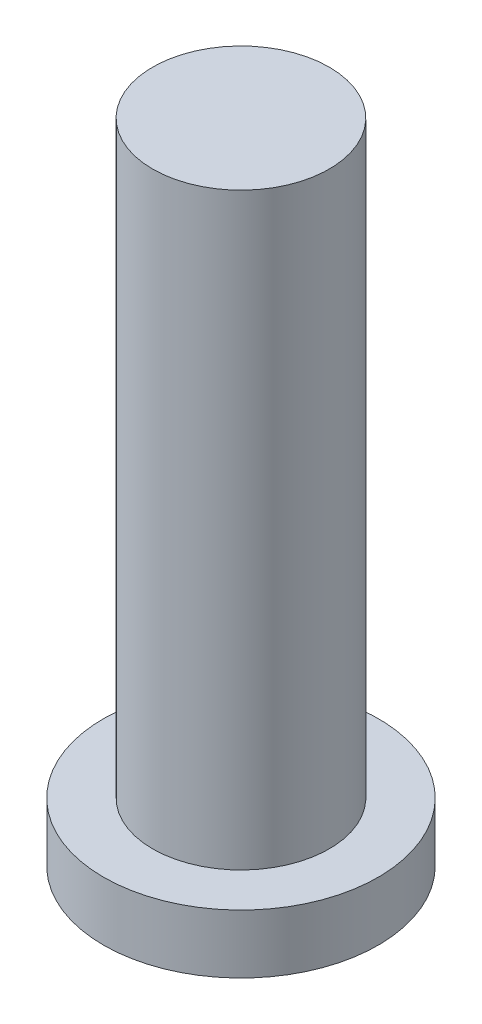
ISO-10303-21;
HEADER;
FILE_DESCRIPTION(('STEP AP214'),'2;1');
FILE_NAME('part.step','',(''),(''),'','','');
FILE_SCHEMA(('AUTOMOTIVE_DESIGN { 1 0 10303 214 1 1 1 1 }'));
ENDSEC;
DATA;
#1=APPLICATION_CONTEXT('core data for automotive mechanical design processes');
#2=APPLICATION_PROTOCOL_DEFINITION('international standard','automotive_design',2000,#1);
#3=PRODUCT_CONTEXT('',#1,'mechanical');
#4=PRODUCT('Part','Part','',(#3));
#5=PRODUCT_RELATED_PRODUCT_CATEGORY('part','',(#4));
#6=PRODUCT_DEFINITION_FORMATION('','',#4);
#7=PRODUCT_DEFINITION_CONTEXT('part definition',#1,'design');
#8=PRODUCT_DEFINITION('design','',#6,#7);
#9=PRODUCT_DEFINITION_SHAPE('','',#8);
#10=(LENGTH_UNIT() NAMED_UNIT(*) SI_UNIT(.MILLI.,.METRE.));
#11=(NAMED_UNIT(*) PLANE_ANGLE_UNIT() SI_UNIT($,.RADIAN.));
#12=(NAMED_UNIT(*) SI_UNIT($,.STERADIAN.) SOLID_ANGLE_UNIT());
#13=UNCERTAINTY_MEASURE_WITH_UNIT(LENGTH_MEASURE(1.E-05),#10,'distance_accuracy_value','');
#14=(GEOMETRIC_REPRESENTATION_CONTEXT(3) GLOBAL_UNCERTAINTY_ASSIGNED_CONTEXT((#13)) GLOBAL_UNIT_ASSIGNED_CONTEXT((#10,
#11,#12)) REPRESENTATION_CONTEXT('',''));
#15=CARTESIAN_POINT('',(0.,0.,0.));
#16=DIRECTION('',(0.,0.,1.));
#17=DIRECTION('',(1.,0.,0.));
#18=AXIS2_PLACEMENT_3D('',#15,#16,#17);
#19=CARTESIAN_POINT('',(0.,60.,0.));
#20=DIRECTION('',(0.,-1.,0.));
#21=DIRECTION('',(0.,0.,-1.));
#22=AXIS2_PLACEMENT_3D('',#19,#20,#21);
#23=CYLINDRICAL_SURFACE('',#22,9.);
#24=CARTESIAN_POINT('',(0.,60.,0.));
#25=DIRECTION('',(0.,1.,0.));
#26=DIRECTION('',(0.,0.,1.));
#27=AXIS2_PLACEMENT_3D('',#24,#25,#26);
#28=CIRCLE('',#27,9.);
#29=CARTESIAN_POINT('',(0.,60.,9.));
#30=VERTEX_POINT('',#29);
#31=EDGE_CURVE('E10',#30,#30,#28,.T.);
#32=ORIENTED_EDGE('',*,*,#31,.F.);
#33=EDGE_LOOP('',(#32));
#34=FACE_BOUND('',#33,.T.);
#35=CARTESIAN_POINT('',(0.,0.,0.));
#36=DIRECTION('',(0.,1.,0.));
#37=DIRECTION('',(0.,0.,1.));
#38=AXIS2_PLACEMENT_3D('',#35,#36,#37);
#39=CIRCLE('',#38,9.);
#40=CARTESIAN_POINT('',(0.,0.,9.));
#41=VERTEX_POINT('',#40);
#42=EDGE_CURVE('E35',#41,#41,#39,.T.);
#43=ORIENTED_EDGE('',*,*,#42,.T.);
#44=EDGE_LOOP('',(#43));
#45=FACE_BOUND('',#44,.T.);
#46=ADVANCED_FACE('F32',(#34,#45),#23,.T.);
#47=CARTESIAN_POINT('',(0.,60.,0.));
#48=DIRECTION('',(0.,1.,0.));
#49=DIRECTION('',(0.,0.,1.));
#50=AXIS2_PLACEMENT_3D('',#47,#48,#49);
#51=PLANE('',#50);
#52=ORIENTED_EDGE('',*,*,#31,.T.);
#53=EDGE_LOOP('',(#52));
#54=FACE_BOUND('',#53,.T.);
#55=ADVANCED_FACE('F63',(#54),#51,.T.);
#56=CARTESIAN_POINT('',(0.,-6.,0.));
#57=DIRECTION('',(0.,1.,0.));
#58=DIRECTION('',(0.,0.,1.));
#59=AXIS2_PLACEMENT_3D('',#56,#57,#58);
#60=CYLINDRICAL_SURFACE('',#59,14.);
#61=CARTESIAN_POINT('',(0.,-6.,0.));
#62=DIRECTION('',(0.,1.,0.));
#63=DIRECTION('',(0.,0.,1.));
#64=AXIS2_PLACEMENT_3D('',#61,#62,#63);
#65=CIRCLE('',#64,14.);
#66=CARTESIAN_POINT('',(0.,-6.,14.));
#67=VERTEX_POINT('',#66);
#68=EDGE_CURVE('E42',#67,#67,#65,.T.);
#69=ORIENTED_EDGE('',*,*,#68,.T.);
#70=EDGE_LOOP('',(#69));
#71=FACE_BOUND('',#70,.T.);
#72=CARTESIAN_POINT('',(0.,0.,0.));
#73=DIRECTION('',(0.,1.,0.));
#74=DIRECTION('',(0.,0.,1.));
#75=AXIS2_PLACEMENT_3D('',#72,#73,#74);
#76=CIRCLE('',#75,14.);
#77=CARTESIAN_POINT('',(0.,0.,14.));
#78=VERTEX_POINT('',#77);
#79=EDGE_CURVE('E44',#78,#78,#76,.T.);
#80=ORIENTED_EDGE('',*,*,#79,.F.);
#81=EDGE_LOOP('',(#80));
#82=FACE_BOUND('',#81,.T.);
#83=ADVANCED_FACE('F50',(#71,#82),#60,.T.);
#84=CARTESIAN_POINT('',(0.,-6.,0.));
#85=DIRECTION('',(0.,1.,0.));
#86=DIRECTION('',(0.,0.,1.));
#87=AXIS2_PLACEMENT_3D('',#84,#85,#86);
#88=PLANE('',#87);
#89=ORIENTED_EDGE('',*,*,#68,.F.);
#90=EDGE_LOOP('',(#89));
#91=FACE_BOUND('',#90,.T.);
#92=ADVANCED_FACE('F53',(#91),#88,.F.);
#93=CARTESIAN_POINT('',(0.,0.,0.));
#94=DIRECTION('',(0.,1.,0.));
#95=DIRECTION('',(0.,0.,1.));
#96=AXIS2_PLACEMENT_3D('',#93,#94,#95);
#97=PLANE('',#96);
#98=ORIENTED_EDGE('',*,*,#42,.F.);
#99=EDGE_LOOP('',(#98));
#100=FACE_BOUND('',#99,.T.);
#101=ORIENTED_EDGE('',*,*,#79,.T.);
#102=EDGE_LOOP('',(#101));
#103=FACE_BOUND('',#102,.T.);
#104=ADVANCED_FACE('F55',(#100,#103),#97,.T.);
#105=CLOSED_SHELL('',(#46,#55,#83,#92,#104));
#106=MANIFOLD_SOLID_BREP('B2',#105);
#107=ADVANCED_BREP_SHAPE_REPRESENTATION('',(#18,#106),#14);
#108=SHAPE_DEFINITION_REPRESENTATION(#9,#107);
ENDSEC;
END-ISO-10303-21;
